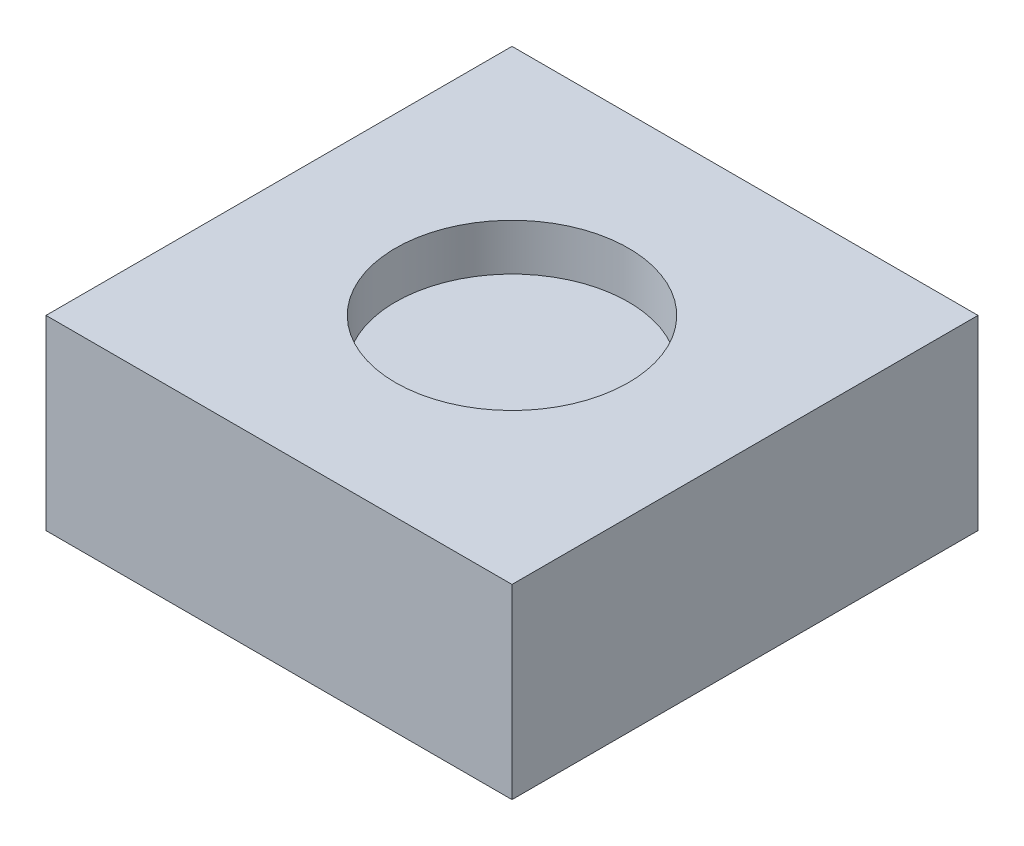
ISO-10303-21;
HEADER;
FILE_DESCRIPTION(('STEP AP214'),'2;1');
FILE_NAME('part.step','',(''),(''),'','','');
FILE_SCHEMA(('AUTOMOTIVE_DESIGN { 1 0 10303 214 1 1 1 1 }'));
ENDSEC;
DATA;
#1=APPLICATION_CONTEXT('core data for automotive mechanical design processes');
#2=APPLICATION_PROTOCOL_DEFINITION('international standard','automotive_design',2000,#1);
#3=PRODUCT_CONTEXT('',#1,'mechanical');
#4=PRODUCT('Part','Part','',(#3));
#5=PRODUCT_RELATED_PRODUCT_CATEGORY('part','',(#4));
#6=PRODUCT_DEFINITION_FORMATION('','',#4);
#7=PRODUCT_DEFINITION_CONTEXT('part definition',#1,'design');
#8=PRODUCT_DEFINITION('design','',#6,#7);
#9=PRODUCT_DEFINITION_SHAPE('','',#8);
#10=(LENGTH_UNIT() NAMED_UNIT(*) SI_UNIT(.MILLI.,.METRE.));
#11=(NAMED_UNIT(*) PLANE_ANGLE_UNIT() SI_UNIT($,.RADIAN.));
#12=(NAMED_UNIT(*) SI_UNIT($,.STERADIAN.) SOLID_ANGLE_UNIT());
#13=UNCERTAINTY_MEASURE_WITH_UNIT(LENGTH_MEASURE(1.E-05),#10,'distance_accuracy_value','');
#14=(GEOMETRIC_REPRESENTATION_CONTEXT(3) GLOBAL_UNCERTAINTY_ASSIGNED_CONTEXT((#13)) GLOBAL_UNIT_ASSIGNED_CONTEXT((#10,
#11,#12)) REPRESENTATION_CONTEXT('',''));
#15=CARTESIAN_POINT('',(0.,0.,0.));
#16=DIRECTION('',(0.,0.,1.));
#17=DIRECTION('',(1.,0.,0.));
#18=AXIS2_PLACEMENT_3D('',#15,#16,#17);
#19=CARTESIAN_POINT('',(10.,8.,10.));
#20=DIRECTION('',(-1.,0.,0.));
#21=DIRECTION('',(0.,0.,1.));
#22=AXIS2_PLACEMENT_3D('',#19,#20,#21);
#23=PLANE('',#22);
#24=DIRECTION('',(0.,0.,-1.));
#25=VECTOR('',#24,1.);
#26=CARTESIAN_POINT('',(10.,0.,10.));
#27=LINE('',#26,#25);
#28=CARTESIAN_POINT('',(10.,0.,10.));
#29=VERTEX_POINT('',#28);
#30=CARTESIAN_POINT('',(10.,0.,-10.));
#31=VERTEX_POINT('',#30);
#32=EDGE_CURVE('E100',#29,#31,#27,.T.);
#33=ORIENTED_EDGE('',*,*,#32,.T.);
#34=DIRECTION('',(0.,-1.,0.));
#35=VECTOR('',#34,1.);
#36=CARTESIAN_POINT('',(10.,8.,-10.));
#37=LINE('',#36,#35);
#38=CARTESIAN_POINT('',(10.,8.,-10.));
#39=VERTEX_POINT('',#38);
#40=EDGE_CURVE('E42',#39,#31,#37,.T.);
#41=ORIENTED_EDGE('',*,*,#40,.F.);
#42=DIRECTION('',(0.,0.,-1.));
#43=VECTOR('',#42,1.);
#44=CARTESIAN_POINT('',(10.,8.,10.));
#45=LINE('',#44,#43);
#46=CARTESIAN_POINT('',(10.,8.,10.));
#47=VERTEX_POINT('',#46);
#48=EDGE_CURVE('E86',#47,#39,#45,.T.);
#49=ORIENTED_EDGE('',*,*,#48,.F.);
#50=DIRECTION('',(0.,-1.,0.));
#51=VECTOR('',#50,1.);
#52=CARTESIAN_POINT('',(10.,8.,10.));
#53=LINE('',#52,#51);
#54=EDGE_CURVE('E96',#47,#29,#53,.T.);
#55=ORIENTED_EDGE('',*,*,#54,.T.);
#56=EDGE_LOOP('',(#33,#41,#49,#55));
#57=FACE_BOUND('',#56,.T.);
#58=ADVANCED_FACE('F33',(#57),#23,.F.);
#59=CARTESIAN_POINT('',(-10.,8.,-10.));
#60=DIRECTION('',(0.,0.,1.));
#61=DIRECTION('',(1.,0.,0.));
#62=AXIS2_PLACEMENT_3D('',#59,#60,#61);
#63=PLANE('',#62);
#64=DIRECTION('',(-1.,0.,0.));
#65=VECTOR('',#64,1.);
#66=CARTESIAN_POINT('',(-10.,0.,-10.));
#67=LINE('',#66,#65);
#68=CARTESIAN_POINT('',(-10.,0.,-10.));
#69=VERTEX_POINT('',#68);
#70=EDGE_CURVE('E91',#31,#69,#67,.T.);
#71=ORIENTED_EDGE('',*,*,#70,.T.);
#72=DIRECTION('',(0.,-1.,0.));
#73=VECTOR('',#72,1.);
#74=CARTESIAN_POINT('',(-10.,8.,-10.));
#75=LINE('',#74,#73);
#76=CARTESIAN_POINT('',(-10.,8.,-10.));
#77=VERTEX_POINT('',#76);
#78=EDGE_CURVE('E89',#77,#69,#75,.T.);
#79=ORIENTED_EDGE('',*,*,#78,.F.);
#80=DIRECTION('',(-1.,0.,0.));
#81=VECTOR('',#80,1.);
#82=CARTESIAN_POINT('',(-10.,8.,-10.));
#83=LINE('',#82,#81);
#84=EDGE_CURVE('E81',#39,#77,#83,.T.);
#85=ORIENTED_EDGE('',*,*,#84,.F.);
#86=ORIENTED_EDGE('',*,*,#40,.T.);
#87=EDGE_LOOP('',(#71,#79,#85,#86));
#88=FACE_BOUND('',#87,.T.);
#89=ADVANCED_FACE('F90',(#88),#63,.F.);
#90=CARTESIAN_POINT('',(-10.,8.,10.));
#91=DIRECTION('',(1.,0.,0.));
#92=DIRECTION('',(0.,0.,-1.));
#93=AXIS2_PLACEMENT_3D('',#90,#91,#92);
#94=PLANE('',#93);
#95=DIRECTION('',(0.,0.,1.));
#96=VECTOR('',#95,1.);
#97=CARTESIAN_POINT('',(-10.,0.,10.));
#98=LINE('',#97,#96);
#99=CARTESIAN_POINT('',(-10.,0.,10.));
#100=VERTEX_POINT('',#99);
#101=EDGE_CURVE('E67',#69,#100,#98,.T.);
#102=ORIENTED_EDGE('',*,*,#101,.T.);
#103=DIRECTION('',(0.,-1.,0.));
#104=VECTOR('',#103,1.);
#105=CARTESIAN_POINT('',(-10.,8.,10.));
#106=LINE('',#105,#104);
#107=CARTESIAN_POINT('',(-10.,8.,10.));
#108=VERTEX_POINT('',#107);
#109=EDGE_CURVE('E92',#108,#100,#106,.T.);
#110=ORIENTED_EDGE('',*,*,#109,.F.);
#111=DIRECTION('',(0.,0.,1.));
#112=VECTOR('',#111,1.);
#113=CARTESIAN_POINT('',(-10.,8.,10.));
#114=LINE('',#113,#112);
#115=EDGE_CURVE('E84',#77,#108,#114,.T.);
#116=ORIENTED_EDGE('',*,*,#115,.F.);
#117=ORIENTED_EDGE('',*,*,#78,.T.);
#118=EDGE_LOOP('',(#102,#110,#116,#117));
#119=FACE_BOUND('',#118,.T.);
#120=ADVANCED_FACE('F94',(#119),#94,.F.);
#121=CARTESIAN_POINT('',(-10.,8.,10.));
#122=DIRECTION('',(0.,0.,-1.));
#123=DIRECTION('',(-1.,0.,0.));
#124=AXIS2_PLACEMENT_3D('',#121,#122,#123);
#125=PLANE('',#124);
#126=DIRECTION('',(1.,0.,0.));
#127=VECTOR('',#126,1.);
#128=CARTESIAN_POINT('',(-10.,0.,10.));
#129=LINE('',#128,#127);
#130=EDGE_CURVE('E73',#100,#29,#129,.T.);
#131=ORIENTED_EDGE('',*,*,#130,.T.);
#132=ORIENTED_EDGE('',*,*,#54,.F.);
#133=DIRECTION('',(1.,0.,0.));
#134=VECTOR('',#133,1.);
#135=CARTESIAN_POINT('',(-10.,8.,10.));
#136=LINE('',#135,#134);
#137=EDGE_CURVE('E50',#108,#47,#136,.T.);
#138=ORIENTED_EDGE('',*,*,#137,.F.);
#139=ORIENTED_EDGE('',*,*,#109,.T.);
#140=EDGE_LOOP('',(#131,#132,#138,#139));
#141=FACE_BOUND('',#140,.T.);
#142=ADVANCED_FACE('F123',(#141),#125,.F.);
#143=CARTESIAN_POINT('',(0.,8.,0.));
#144=DIRECTION('',(0.,-1.,0.));
#145=DIRECTION('',(0.,0.,-1.));
#146=AXIS2_PLACEMENT_3D('',#143,#144,#145);
#147=PLANE('',#146);
#148=CARTESIAN_POINT('',(0.,8.,0.));
#149=DIRECTION('',(0.,1.,0.));
#150=DIRECTION('',(0.,0.,1.));
#151=AXIS2_PLACEMENT_3D('',#148,#149,#150);
#152=CIRCLE('',#151,5.);
#153=CARTESIAN_POINT('',(0.,8.,5.));
#154=VERTEX_POINT('',#153);
#155=EDGE_CURVE('E189',#154,#154,#152,.T.);
#156=ORIENTED_EDGE('',*,*,#155,.F.);
#157=EDGE_LOOP('',(#156));
#158=FACE_BOUND('',#157,.T.);
#159=ORIENTED_EDGE('',*,*,#48,.T.);
#160=ORIENTED_EDGE('',*,*,#84,.T.);
#161=ORIENTED_EDGE('',*,*,#115,.T.);
#162=ORIENTED_EDGE('',*,*,#137,.T.);
#163=EDGE_LOOP('',(#159,#160,#161,#162));
#164=FACE_BOUND('',#163,.T.);
#165=ADVANCED_FACE('F82',(#158,#164),#147,.F.);
#166=CARTESIAN_POINT('',(0.,0.,0.));
#167=DIRECTION('',(0.,-1.,0.));
#168=DIRECTION('',(0.,0.,-1.));
#169=AXIS2_PLACEMENT_3D('',#166,#167,#168);
#170=PLANE('',#169);
#171=CARTESIAN_POINT('',(0.,0.,0.));
#172=DIRECTION('',(0.,-1.,0.));
#173=DIRECTION('',(0.,0.,-1.));
#174=AXIS2_PLACEMENT_3D('',#171,#172,#173);
#175=CIRCLE('',#174,1.);
#176=CARTESIAN_POINT('',(0.,0.,-1.));
#177=VERTEX_POINT('',#176);
#178=EDGE_CURVE('E188',#177,#177,#175,.T.);
#179=ORIENTED_EDGE('',*,*,#178,.F.);
#180=EDGE_LOOP('',(#179));
#181=FACE_BOUND('',#180,.T.);
#182=ORIENTED_EDGE('',*,*,#32,.F.);
#183=ORIENTED_EDGE('',*,*,#130,.F.);
#184=ORIENTED_EDGE('',*,*,#101,.F.);
#185=ORIENTED_EDGE('',*,*,#70,.F.);
#186=EDGE_LOOP('',(#182,#183,#184,#185));
#187=FACE_BOUND('',#186,.T.);
#188=ADVANCED_FACE('F111',(#181,#187),#170,.T.);
#189=CARTESIAN_POINT('',(0.,6.,0.));
#190=DIRECTION('',(0.,1.,0.));
#191=DIRECTION('',(0.,0.,1.));
#192=AXIS2_PLACEMENT_3D('',#189,#190,#191);
#193=CYLINDRICAL_SURFACE('',#192,5.);
#194=CARTESIAN_POINT('',(0.,6.,0.));
#195=DIRECTION('',(0.,1.,0.));
#196=DIRECTION('',(0.,0.,1.));
#197=AXIS2_PLACEMENT_3D('',#194,#195,#196);
#198=CIRCLE('',#197,5.);
#199=CARTESIAN_POINT('',(0.,6.,5.));
#200=VERTEX_POINT('',#199);
#201=EDGE_CURVE('E103',#200,#200,#198,.T.);
#202=ORIENTED_EDGE('',*,*,#201,.F.);
#203=EDGE_LOOP('',(#202));
#204=FACE_BOUND('',#203,.T.);
#205=ORIENTED_EDGE('',*,*,#155,.T.);
#206=EDGE_LOOP('',(#205));
#207=FACE_BOUND('',#206,.T.);
#208=ADVANCED_FACE('F113',(#204,#207),#193,.F.);
#209=CARTESIAN_POINT('',(0.,6.,0.));
#210=DIRECTION('',(0.,1.,0.));
#211=DIRECTION('',(0.,0.,1.));
#212=AXIS2_PLACEMENT_3D('',#209,#210,#211);
#213=PLANE('',#212);
#214=ORIENTED_EDGE('',*,*,#201,.T.);
#215=EDGE_LOOP('',(#214));
#216=FACE_BOUND('',#215,.T.);
#217=ADVANCED_FACE('F120',(#216),#213,.T.);
#218=CARTESIAN_POINT('',(0.,2.,0.));
#219=DIRECTION('',(0.,-1.,0.));
#220=DIRECTION('',(0.,0.,-1.));
#221=AXIS2_PLACEMENT_3D('',#218,#219,#220);
#222=CYLINDRICAL_SURFACE('',#221,1.);
#223=CARTESIAN_POINT('',(0.,1.,0.));
#224=DIRECTION('',(0.,-1.,0.));
#225=DIRECTION('',(0.,0.,-1.));
#226=AXIS2_PLACEMENT_3D('',#223,#224,#225);
#227=CIRCLE('',#226,1.);
#228=CARTESIAN_POINT('',(0.,1.,-1.));
#229=VERTEX_POINT('',#228);
#230=EDGE_CURVE('E11',#229,#229,#227,.F.);
#231=ORIENTED_EDGE('',*,*,#230,.T.);
#232=EDGE_LOOP('',(#231));
#233=FACE_BOUND('',#232,.T.);
#234=ORIENTED_EDGE('',*,*,#178,.T.);
#235=EDGE_LOOP('',(#234));
#236=FACE_BOUND('',#235,.T.);
#237=ADVANCED_FACE('F159',(#233,#236),#222,.F.);
#238=CARTESIAN_POINT('',(0.,1.,0.));
#239=DIRECTION('',(0.,-1.,0.));
#240=DIRECTION('',(0.,0.,-1.));
#241=AXIS2_PLACEMENT_3D('',#238,#239,#240);
#242=SPHERICAL_SURFACE('',#241,1.);
#243=ORIENTED_EDGE('',*,*,#230,.F.);
#244=EDGE_LOOP('',(#243));
#245=FACE_BOUND('',#244,.T.);
#246=ADVANCED_FACE('F35',(#245),#242,.F.);
#247=CLOSED_SHELL('',(#58,#89,#120,#142,#165,#188,#208,#217,#237,#246));
#248=MANIFOLD_SOLID_BREP('B2',#247);
#249=ADVANCED_BREP_SHAPE_REPRESENTATION('',(#18,#248),#14);
#250=SHAPE_DEFINITION_REPRESENTATION(#9,#249);
ENDSEC;
END-ISO-10303-21;
